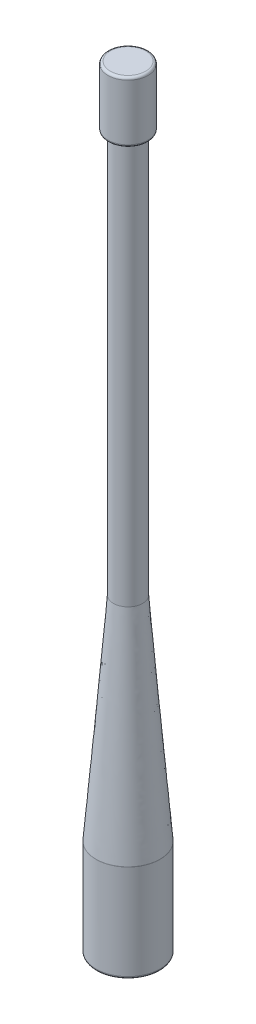
ISO-10303-21;
HEADER;
FILE_DESCRIPTION(('STEP AP214'),'2;1');
FILE_NAME('part.step','',(''),(''),'','','');
FILE_SCHEMA(('AUTOMOTIVE_DESIGN { 1 0 10303 214 1 1 1 1 }'));
ENDSEC;
DATA;
#1=APPLICATION_CONTEXT('core data for automotive mechanical design processes');
#2=APPLICATION_PROTOCOL_DEFINITION('international standard','automotive_design',2000,#1);
#3=PRODUCT_CONTEXT('',#1,'mechanical');
#4=PRODUCT('Part','Part','',(#3));
#5=PRODUCT_RELATED_PRODUCT_CATEGORY('part','',(#4));
#6=PRODUCT_DEFINITION_FORMATION('','',#4);
#7=PRODUCT_DEFINITION_CONTEXT('part definition',#1,'design');
#8=PRODUCT_DEFINITION('design','',#6,#7);
#9=PRODUCT_DEFINITION_SHAPE('','',#8);
#10=(LENGTH_UNIT() NAMED_UNIT(*) SI_UNIT(.MILLI.,.METRE.));
#11=(NAMED_UNIT(*) PLANE_ANGLE_UNIT() SI_UNIT($,.RADIAN.));
#12=(NAMED_UNIT(*) SI_UNIT($,.STERADIAN.) SOLID_ANGLE_UNIT());
#13=UNCERTAINTY_MEASURE_WITH_UNIT(LENGTH_MEASURE(1.E-05),#10,'distance_accuracy_value','');
#14=(GEOMETRIC_REPRESENTATION_CONTEXT(3) GLOBAL_UNCERTAINTY_ASSIGNED_CONTEXT((#13)) GLOBAL_UNIT_ASSIGNED_CONTEXT((#10,
#11,#12)) REPRESENTATION_CONTEXT('',''));
#15=CARTESIAN_POINT('',(0.,0.,0.));
#16=DIRECTION('',(0.,0.,1.));
#17=DIRECTION('',(1.,0.,0.));
#18=AXIS2_PLACEMENT_3D('',#15,#16,#17);
#19=CARTESIAN_POINT('',(0.,20.32,0.));
#20=DIRECTION('',(0.,-1.,0.));
#21=DIRECTION('',(0.,0.,-1.));
#22=AXIS2_PLACEMENT_3D('',#19,#20,#21);
#23=CYLINDRICAL_SURFACE('',#22,6.6675);
#24=CARTESIAN_POINT('',(0.,20.2987000456699,0.));
#25=DIRECTION('',(0.,-1.,0.));
#26=DIRECTION('',(0.,0.,-1.));
#27=AXIS2_PLACEMENT_3D('',#24,#25,#26);
#28=CIRCLE('',#27,6.6675);
#29=CARTESIAN_POINT('',(0.,20.2987000456699,-6.6675));
#30=VERTEX_POINT('',#29);
#31=EDGE_CURVE('E55',#30,#30,#28,.T.);
#32=ORIENTED_EDGE('',*,*,#31,.T.);
#33=EDGE_LOOP('',(#32));
#34=FACE_BOUND('',#33,.T.);
#35=CARTESIAN_POINT('',(0.,0.508000000000002,0.));
#36=DIRECTION('',(0.,1.,0.));
#37=DIRECTION('',(0.,0.,1.));
#38=AXIS2_PLACEMENT_3D('',#35,#36,#37);
#39=CIRCLE('',#38,6.6675);
#40=CARTESIAN_POINT('',(0.,0.508000000000002,6.6675));
#41=VERTEX_POINT('',#40);
#42=EDGE_CURVE('E58',#41,#41,#39,.T.);
#43=ORIENTED_EDGE('',*,*,#42,.T.);
#44=EDGE_LOOP('',(#43));
#45=FACE_BOUND('',#44,.T.);
#46=ADVANCED_FACE('F32',(#34,#45),#23,.T.);
#47=CARTESIAN_POINT('',(0.,0.,0.));
#48=DIRECTION('',(0.,1.,0.));
#49=DIRECTION('',(0.,0.,1.));
#50=AXIS2_PLACEMENT_3D('',#47,#48,#49);
#51=PLANE('',#50);
#52=CARTESIAN_POINT('',(0.,0.,0.));
#53=DIRECTION('',(0.,1.,0.));
#54=DIRECTION('',(0.,0.,1.));
#55=AXIS2_PLACEMENT_3D('',#52,#53,#54);
#56=CIRCLE('',#55,6.1595);
#57=CARTESIAN_POINT('',(0.,0.,6.1595));
#58=VERTEX_POINT('',#57);
#59=EDGE_CURVE('E52',#58,#58,#56,.F.);
#60=ORIENTED_EDGE('',*,*,#59,.T.);
#61=EDGE_LOOP('',(#60));
#62=FACE_BOUND('',#61,.T.);
#63=ADVANCED_FACE('F98',(#62),#51,.F.);
#64=CARTESIAN_POINT('',(0.590355184554475,64.77,-2.99028171851243));
#65=CARTESIAN_POINT('',(3.01951385710795,20.32,-5.94458512570331));
#66=CARTESIAN_POINT('',(6.57091862157933,64.77,-1.80957134940348));
#67=CARTESIAN_POINT('',(14.9086841085146,20.32,0.0944425885125956));
#68=CARTESIAN_POINT('',(5.39020825247038,64.77,4.17099208762138));
#69=CARTESIAN_POINT('',(8.86965639429867,20.32,11.9836128399192));
#70=CARTESIAN_POINT('',(-0.590355184554475,64.77,2.99028171851243));
#71=CARTESIAN_POINT('',(-3.01951385710795,20.32,5.94458512570331));
#72=CARTESIAN_POINT('',(-6.57091862157933,64.77,1.80957134940348));
#73=CARTESIAN_POINT('',(-14.9086841085146,20.32,-0.0944425885125973));
#74=CARTESIAN_POINT('',(-5.39020825247038,64.77,-4.17099208762138));
#75=CARTESIAN_POINT('',(-8.86965639429867,20.32,-11.9836128399192));
#76=CARTESIAN_POINT('',(0.590355184554475,64.77,-2.99028171851243));
#77=CARTESIAN_POINT('',(3.01951385710795,20.32,-5.94458512570331));
#78=(BOUNDED_SURFACE() B_SPLINE_SURFACE(3,1,((#64,#65),(#66,#67),(#68,#69),(#70,#71),(#72,#73),
(#74,#75),(#76,#77)),.UNSPECIFIED.,.T.,.F.,.F.) B_SPLINE_SURFACE_WITH_KNOTS((4,3,4),(2,2),(0.,
0.5,1.),(0.,1.),.UNSPECIFIED.) GEOMETRIC_REPRESENTATION_ITEM() RATIONAL_B_SPLINE_SURFACE(((1.,
1.),(0.333333333333333,0.333333333333333),(0.333333333333333,0.333333333333333),(1.,1.),
(0.333333333333333,0.333333333333333),(0.333333333333333,0.333333333333333),(1.,1.))) REPRESENTATION_ITEM('') SURFACE());
#79=CARTESIAN_POINT('',(0.,20.3412249155422,0.));
#80=DIRECTION('',(0.,-1.,0.));
#81=DIRECTION('',(0.,0.,-1.));
#82=AXIS2_PLACEMENT_3D('',#79,#80,#81);
#83=CIRCLE('',#82,6.6657169845455);
#84=CARTESIAN_POINT('',(3.01835393162621,20.3412249155422,-5.9431744431318));
#85=VERTEX_POINT('',#84);
#86=EDGE_CURVE('E61',#85,#85,#83,.F.);
#87=CARTESIAN_POINT('',(0.,64.77,0.));
#88=DIRECTION('',(0.,1.,0.));
#89=DIRECTION('',(0.,0.,1.));
#90=AXIS2_PLACEMENT_3D('',#87,#88,#89);
#91=CIRCLE('',#90,3.048);
#92=CARTESIAN_POINT('',(0.590355184554475,64.77,-2.99028171851243));
#93=VERTEX_POINT('',#92);
#94=EDGE_CURVE('E64',#93,#93,#91,.T.);
#95=CARTESIAN_POINT('',(3.01835393162621,20.3412249155422,-5.9431744431318));
#96=CARTESIAN_POINT('',(2.99306227801088,20.8040246560053,-5.91241514391701));
#97=CARTESIAN_POINT('',(2.96777062439555,21.2668243964684,-5.88165584470223));
#98=CARTESIAN_POINT('',(2.91718731716488,22.1924238773946,-5.82013724627266));
#99=CARTESIAN_POINT('',(2.89189566354955,22.6552236178577,-5.78937794705787));
#100=CARTESIAN_POINT('',(2.84131235631889,23.5808230987839,-5.7278593486283));
#101=CARTESIAN_POINT('',(2.81602070270356,24.043622839247,-5.69710004941352));
#102=CARTESIAN_POINT('',(2.7654373954729,24.9692223201732,-5.63558145098395));
#103=CARTESIAN_POINT('',(2.74014574185757,25.4320220606363,-5.60482215176916));
#104=CARTESIAN_POINT('',(2.68956243462691,26.3576215415626,-5.54330355333959));
#105=CARTESIAN_POINT('',(2.66427078101158,26.8204212820256,-5.51254425412481));
#106=CARTESIAN_POINT('',(2.61368747378092,27.7460207629519,-5.45102565569524));
#107=CARTESIAN_POINT('',(2.58839582016559,28.208820503415,-5.42026635648045));
#108=CARTESIAN_POINT('',(2.53781251293493,29.1344199843412,-5.35874775805088));
#109=CARTESIAN_POINT('',(2.5125208593196,29.5972197248043,-5.3279884588361));
#110=CARTESIAN_POINT('',(2.46193755208894,30.5228192057305,-5.26646986040653));
#111=CARTESIAN_POINT('',(2.4366458984736,30.9856189461936,-5.23571056119174));
#112=CARTESIAN_POINT('',(2.38606259124294,31.9112184271198,-5.17419196276217));
#113=CARTESIAN_POINT('',(2.36077093762761,32.3740181675829,-5.14343266354739));
#114=CARTESIAN_POINT('',(2.31018763039695,33.2996176485091,-5.08191406511782));
#115=CARTESIAN_POINT('',(2.28489597678162,33.7624173889722,-5.05115476590303));
#116=CARTESIAN_POINT('',(2.23431266955096,34.6880168698984,-4.98963616747346));
#117=CARTESIAN_POINT('',(2.20902101593563,35.1508166103615,-4.95887686825867));
#118=CARTESIAN_POINT('',(2.15843770870497,36.0764160912877,-4.8973582698291));
#119=CARTESIAN_POINT('',(2.13314605508964,36.5392158317508,-4.86659897061432));
#120=CARTESIAN_POINT('',(2.08256274785898,37.464815312677,-4.80508037218475));
#121=CARTESIAN_POINT('',(2.05727109424365,37.9276150531401,-4.77432107296996));
#122=CARTESIAN_POINT('',(2.00668778701299,38.8532145340663,-4.7128024745404));
#123=CARTESIAN_POINT('',(1.98139613339766,39.3160142745294,-4.68204317532561));
#124=CARTESIAN_POINT('',(1.93081282616699,40.2416137554556,-4.62052457689604));
#125=CARTESIAN_POINT('',(1.90552117255166,40.7044134959187,-4.58976527768125));
#126=CARTESIAN_POINT('',(1.854937865321,41.6300129768449,-4.52824667925168));
#127=CARTESIAN_POINT('',(1.82964621170567,42.092812717308,-4.4974873800369));
#128=CARTESIAN_POINT('',(1.77906290447501,43.0184121982342,-4.43596878160733));
#129=CARTESIAN_POINT('',(1.75377125085968,43.4812119386973,-4.40520948239254));
#130=CARTESIAN_POINT('',(1.70318794362902,44.4068114196235,-4.34369088396297));
#131=CARTESIAN_POINT('',(1.67789629001369,44.8696111600866,-4.31293158474819));
#132=CARTESIAN_POINT('',(1.62731298278303,45.7952106410128,-4.25141298631862));
#133=CARTESIAN_POINT('',(1.6020213291677,46.2580103814759,-4.22065368710383));
#134=CARTESIAN_POINT('',(1.55143802193704,47.1836098624021,-4.15913508867426));
#135=CARTESIAN_POINT('',(1.5261463683217,47.6464096028652,-4.12837578945948));
#136=CARTESIAN_POINT('',(1.47556306109104,48.5720090837914,-4.06685719102991));
#137=CARTESIAN_POINT('',(1.45027140747571,49.0348088242545,-4.03609789181512));
#138=CARTESIAN_POINT('',(1.39968810024505,49.9604083051807,-3.97457929338555));
#139=CARTESIAN_POINT('',(1.37439644662972,50.4232080456438,-3.94381999417077));
#140=CARTESIAN_POINT('',(1.32381313939906,51.34880752657,-3.8823013957412));
#141=CARTESIAN_POINT('',(1.29852148578373,51.8116072670331,-3.85154209652641));
#142=CARTESIAN_POINT('',(1.24793817855307,52.7372067479593,-3.79002349809684));
#143=CARTESIAN_POINT('',(1.22264652493774,53.2000064884225,-3.75926419888206));
#144=CARTESIAN_POINT('',(1.17206321770708,54.1256059693486,-3.69774560045249));
#145=CARTESIAN_POINT('',(1.14677156409175,54.5884057098118,-3.6669863012377));
#146=CARTESIAN_POINT('',(1.09618825686109,55.514005190738,-3.60546770280813));
#147=CARTESIAN_POINT('',(1.07089660324575,55.9768049312011,-3.57470840359335));
#148=CARTESIAN_POINT('',(1.02031329601509,56.9024044121273,-3.51318980516378));
#149=CARTESIAN_POINT('',(0.995021642399763,57.3652041525904,-3.48243050594899));
#150=CARTESIAN_POINT('',(0.944438335169102,58.2908036335166,-3.42091190751942));
#151=CARTESIAN_POINT('',(0.919146681553772,58.7536033739797,-3.39015260830464));
#152=CARTESIAN_POINT('',(0.86856337432311,59.6792028549059,-3.32863400987507));
#153=CARTESIAN_POINT('',(0.84327172070778,60.142002595369,-3.29787471066028));
#154=CARTESIAN_POINT('',(0.792688413477119,61.0676020762952,-3.23635611223071));
#155=CARTESIAN_POINT('',(0.767396759861788,61.5304018167583,-3.20559681301593));
#156=CARTESIAN_POINT('',(0.716813452631127,62.4560012976845,-3.14407821458636));
#157=CARTESIAN_POINT('',(0.691521799015797,62.9188010381476,-3.11331891537157));
#158=CARTESIAN_POINT('',(0.640938491785136,63.8444005190738,-3.051800316942));
#159=CARTESIAN_POINT('',(0.615646838169805,64.3072002595369,-3.02104101772722));
#160=CARTESIAN_POINT('',(0.590355184554475,64.77,-2.99028171851243));
#161=B_SPLINE_CURVE_WITH_KNOTS('',3,(#95,#96,#97,#98,#99,#100,#101,#102,#103,#104,#105,#106,
#107,#108,#109,#110,#111,#112,#113,#114,#115,#116,#117,#118,#119,#120,#121,#122,#123,#124,#125,
#126,#127,#128,#129,#130,#131,#132,#133,#134,#135,#136,#137,#138,#139,#140,#141,#142,#143,#144,
#145,#146,#147,#148,#149,#150,#151,#152,#153,#154,#155,#156,#157,#158,#159,#160),.UNSPECIFIED.,
.F.,.F.,(4,2,2,2,2,2,2,2,2,2,2,2,2,2,2,2,2,2,2,2,2,2,2,2,2,2,2,2,2,2,2,2,4),(0.,
1.39352955405742,2.78705910811483,4.18058866217226,5.57411821622968,6.96764777028709,
8.36117732434452,9.75470687840194,11.1482364324594,12.5417659865168,13.9352955405742,
15.3288250946316,16.722354648689,18.1158842027465,19.5094137568039,20.9029433108613,
22.2964728649187,23.6900024189761,25.0835319730336,26.477061527091,27.8705910811484,
29.2641206352058,30.6576501892632,32.0511797433207,33.4447092973781,34.8382388514355,
36.2317684054929,37.6252979595503,39.0188275136078,40.4123570676652,41.8058866217226,
43.19941617578,44.5929457298374),.UNSPECIFIED.);
#162=EDGE_CURVE('BSEAM83',#85,#93,#161,.T.);
#163=ORIENTED_EDGE('',*,*,#86,.T.);
#164=ORIENTED_EDGE('',*,*,#94,.F.);
#165=ORIENTED_EDGE('',*,*,#162,.T.);
#166=ORIENTED_EDGE('',*,*,#162,.F.);
#167=EDGE_LOOP('',(#163,#165,#164,#166));
#168=FACE_BOUND('',#167,.T.);
#169=ADVANCED_FACE('F83',(#168),#78,.T.);
#170=CARTESIAN_POINT('',(0.,148.59,0.));
#171=DIRECTION('',(0.,-1.,0.));
#172=DIRECTION('',(0.,0.,-1.));
#173=AXIS2_PLACEMENT_3D('',#170,#171,#172);
#174=CYLINDRICAL_SURFACE('',#173,3.048);
#175=CARTESIAN_POINT('',(0.,148.59,0.));
#176=DIRECTION('',(0.,1.,0.));
#177=DIRECTION('',(0.,0.,1.));
#178=AXIS2_PLACEMENT_3D('',#175,#176,#177);
#179=CIRCLE('',#178,3.048);
#180=CARTESIAN_POINT('',(0.,148.59,3.048));
#181=VERTEX_POINT('',#180);
#182=EDGE_CURVE('E68',#181,#181,#179,.T.);
#183=ORIENTED_EDGE('',*,*,#182,.F.);
#184=EDGE_LOOP('',(#183));
#185=FACE_BOUND('',#184,.T.);
#186=ORIENTED_EDGE('',*,*,#94,.T.);
#187=EDGE_LOOP('',(#186));
#188=FACE_BOUND('',#187,.T.);
#189=ADVANCED_FACE('F81',(#185,#188),#174,.T.);
#190=CARTESIAN_POINT('',(0.,161.29,0.));
#191=DIRECTION('',(0.,-1.,0.));
#192=DIRECTION('',(0.,0.,-1.));
#193=AXIS2_PLACEMENT_3D('',#190,#191,#192);
#194=CYLINDRICAL_SURFACE('',#193,4.191);
#195=CARTESIAN_POINT('',(0.,160.782,0.));
#196=DIRECTION('',(0.,1.,0.));
#197=DIRECTION('',(0.,0.,1.));
#198=AXIS2_PLACEMENT_3D('',#195,#196,#197);
#199=CIRCLE('',#198,4.191);
#200=CARTESIAN_POINT('',(0.,160.782,4.191));
#201=VERTEX_POINT('',#200);
#202=EDGE_CURVE('E39',#201,#201,#199,.F.);
#203=ORIENTED_EDGE('',*,*,#202,.T.);
#204=EDGE_LOOP('',(#203));
#205=FACE_BOUND('',#204,.T.);
#206=CARTESIAN_POINT('',(0.,149.098,0.));
#207=DIRECTION('',(0.,1.,0.));
#208=DIRECTION('',(0.,0.,1.));
#209=AXIS2_PLACEMENT_3D('',#206,#207,#208);
#210=CIRCLE('',#209,4.191);
#211=CARTESIAN_POINT('',(0.,149.098,4.191));
#212=VERTEX_POINT('',#211);
#213=EDGE_CURVE('E43',#212,#212,#210,.T.);
#214=ORIENTED_EDGE('',*,*,#213,.T.);
#215=EDGE_LOOP('',(#214));
#216=FACE_BOUND('',#215,.T.);
#217=ADVANCED_FACE('F91',(#205,#216),#194,.T.);
#218=CARTESIAN_POINT('',(0.,161.29,0.));
#219=DIRECTION('',(0.,1.,0.));
#220=DIRECTION('',(0.,0.,1.));
#221=AXIS2_PLACEMENT_3D('',#218,#219,#220);
#222=PLANE('',#221);
#223=CARTESIAN_POINT('',(0.,161.29,0.));
#224=DIRECTION('',(0.,1.,0.));
#225=DIRECTION('',(0.,0.,1.));
#226=AXIS2_PLACEMENT_3D('',#223,#224,#225);
#227=CIRCLE('',#226,3.683);
#228=CARTESIAN_POINT('',(0.,161.29,3.683));
#229=VERTEX_POINT('',#228);
#230=EDGE_CURVE('E47',#229,#229,#227,.T.);
#231=ORIENTED_EDGE('',*,*,#230,.T.);
#232=EDGE_LOOP('',(#231));
#233=FACE_BOUND('',#232,.T.);
#234=ADVANCED_FACE('F96',(#233),#222,.T.);
#235=CARTESIAN_POINT('',(0.,148.59,0.));
#236=DIRECTION('',(0.,1.,0.));
#237=DIRECTION('',(0.,0.,1.));
#238=AXIS2_PLACEMENT_3D('',#235,#236,#237);
#239=PLANE('',#238);
#240=CARTESIAN_POINT('',(0.,148.59,0.));
#241=DIRECTION('',(0.,1.,0.));
#242=DIRECTION('',(0.,0.,1.));
#243=AXIS2_PLACEMENT_3D('',#240,#241,#242);
#244=CIRCLE('',#243,3.683);
#245=CARTESIAN_POINT('',(0.,148.59,3.683));
#246=VERTEX_POINT('',#245);
#247=EDGE_CURVE('E11',#246,#246,#244,.F.);
#248=ORIENTED_EDGE('',*,*,#247,.T.);
#249=EDGE_LOOP('',(#248));
#250=FACE_BOUND('',#249,.T.);
#251=ORIENTED_EDGE('',*,*,#182,.T.);
#252=EDGE_LOOP('',(#251));
#253=FACE_BOUND('',#252,.T.);
#254=ADVANCED_FACE('F88',(#250,#253),#239,.F.);
#255=CARTESIAN_POINT('',(0.,20.2987000456699,0.));
#256=DIRECTION('',(0.,-1.,0.));
#257=DIRECTION('',(0.,0.,-1.));
#258=AXIS2_PLACEMENT_3D('',#255,#256,#257);
#259=TOROIDAL_SURFACE('',#258,6.1595,0.508);
#260=ORIENTED_EDGE('',*,*,#31,.F.);
#261=EDGE_LOOP('',(#260));
#262=FACE_BOUND('',#261,.T.);
#263=ORIENTED_EDGE('',*,*,#86,.F.);
#264=EDGE_LOOP('',(#263));
#265=FACE_BOUND('',#264,.T.);
#266=ADVANCED_FACE('F111',(#262,#265),#259,.T.);
#267=CARTESIAN_POINT('',(0.,0.508000000000002,0.));
#268=DIRECTION('',(0.,1.,0.));
#269=DIRECTION('',(0.,0.,1.));
#270=AXIS2_PLACEMENT_3D('',#267,#268,#269);
#271=TOROIDAL_SURFACE('',#270,6.1595,0.508);
#272=ORIENTED_EDGE('',*,*,#59,.F.);
#273=EDGE_LOOP('',(#272));
#274=FACE_BOUND('',#273,.T.);
#275=ORIENTED_EDGE('',*,*,#42,.F.);
#276=EDGE_LOOP('',(#275));
#277=FACE_BOUND('',#276,.T.);
#278=ADVANCED_FACE('F114',(#274,#277),#271,.T.);
#279=CARTESIAN_POINT('',(0.,160.782,0.));
#280=DIRECTION('',(0.,1.,0.));
#281=DIRECTION('',(0.,0.,1.));
#282=AXIS2_PLACEMENT_3D('',#279,#280,#281);
#283=TOROIDAL_SURFACE('',#282,3.683,0.508);
#284=ORIENTED_EDGE('',*,*,#202,.F.);
#285=EDGE_LOOP('',(#284));
#286=FACE_BOUND('',#285,.T.);
#287=ORIENTED_EDGE('',*,*,#230,.F.);
#288=EDGE_LOOP('',(#287));
#289=FACE_BOUND('',#288,.T.);
#290=ADVANCED_FACE('F117',(#286,#289),#283,.T.);
#291=CARTESIAN_POINT('',(0.,149.098,0.));
#292=DIRECTION('',(0.,1.,0.));
#293=DIRECTION('',(0.,0.,1.));
#294=AXIS2_PLACEMENT_3D('',#291,#292,#293);
#295=TOROIDAL_SURFACE('',#294,3.683,0.508);
#296=ORIENTED_EDGE('',*,*,#247,.F.);
#297=EDGE_LOOP('',(#296));
#298=FACE_BOUND('',#297,.T.);
#299=ORIENTED_EDGE('',*,*,#213,.F.);
#300=EDGE_LOOP('',(#299));
#301=FACE_BOUND('',#300,.T.);
#302=ADVANCED_FACE('F34',(#298,#301),#295,.T.);
#303=CLOSED_SHELL('',(#46,#63,#169,#189,#217,#234,#254,#266,#278,#290,#302));
#304=MANIFOLD_SOLID_BREP('B2',#303);
#305=ADVANCED_BREP_SHAPE_REPRESENTATION('',(#18,#304),#14);
#306=SHAPE_DEFINITION_REPRESENTATION(#9,#305);
ENDSEC;
END-ISO-10303-21;
